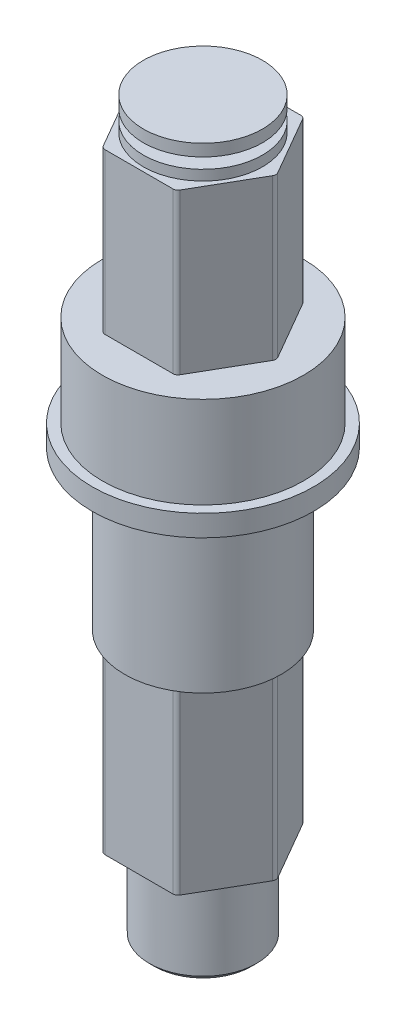
ISO-10303-21;
HEADER;
FILE_DESCRIPTION(('STEP AP214'),'2;1');
FILE_NAME('part.step','',(''),(''),'','','');
FILE_SCHEMA(('AUTOMOTIVE_DESIGN { 1 0 10303 214 1 1 1 1 }'));
ENDSEC;
DATA;
#1=APPLICATION_CONTEXT('core data for automotive mechanical design processes');
#2=APPLICATION_PROTOCOL_DEFINITION('international standard','automotive_design',2000,#1);
#3=PRODUCT_CONTEXT('',#1,'mechanical');
#4=PRODUCT('Part','Part','',(#3));
#5=PRODUCT_RELATED_PRODUCT_CATEGORY('part','',(#4));
#6=PRODUCT_DEFINITION_FORMATION('','',#4);
#7=PRODUCT_DEFINITION_CONTEXT('part definition',#1,'design');
#8=PRODUCT_DEFINITION('design','',#6,#7);
#9=PRODUCT_DEFINITION_SHAPE('','',#8);
#10=(LENGTH_UNIT() NAMED_UNIT(*) SI_UNIT(.MILLI.,.METRE.));
#11=(NAMED_UNIT(*) PLANE_ANGLE_UNIT() SI_UNIT($,.RADIAN.));
#12=(NAMED_UNIT(*) SI_UNIT($,.STERADIAN.) SOLID_ANGLE_UNIT());
#13=UNCERTAINTY_MEASURE_WITH_UNIT(LENGTH_MEASURE(1.E-05),#10,'distance_accuracy_value','');
#14=(GEOMETRIC_REPRESENTATION_CONTEXT(3) GLOBAL_UNCERTAINTY_ASSIGNED_CONTEXT((#13)) GLOBAL_UNIT_ASSIGNED_CONTEXT((#10,
#11,#12)) REPRESENTATION_CONTEXT('',''));
#15=CARTESIAN_POINT('',(0.,0.,0.));
#16=DIRECTION('',(0.,0.,1.));
#17=DIRECTION('',(1.,0.,0.));
#18=AXIS2_PLACEMENT_3D('',#15,#16,#17);
#19=CARTESIAN_POINT('',(0.,32.222260168,0.));
#20=DIRECTION('',(0.,1.,0.));
#21=DIRECTION('',(1.,0.,0.));
#22=AXIS2_PLACEMENT_3D('',#19,#20,#21);
#23=PLANE('',#22);
#24=CARTESIAN_POINT('',(0.,32.222260168,0.));
#25=DIRECTION('',(0.,-1.,0.));
#26=DIRECTION('',(0.,0.,1.));
#27=AXIS2_PLACEMENT_3D('',#24,#25,#26);
#28=CIRCLE('',#27,5.842);
#29=CARTESIAN_POINT('',(0.,32.222260168,5.842));
#30=VERTEX_POINT('',#29);
#31=EDGE_CURVE('E598',#30,#30,#28,.T.);
#32=ORIENTED_EDGE('',*,*,#31,.F.);
#33=EDGE_LOOP('',(#32));
#34=FACE_BOUND('',#33,.T.);
#35=CARTESIAN_POINT('',(0.,32.222260168,0.));
#36=DIRECTION('',(0.,1.,0.));
#37=DIRECTION('',(0.,0.,1.));
#38=AXIS2_PLACEMENT_3D('',#35,#36,#37);
#39=CIRCLE('',#38,8.255);
#40=CARTESIAN_POINT('',(0.,32.222260168,8.255));
#41=VERTEX_POINT('',#40);
#42=EDGE_CURVE('E417',#41,#41,#39,.T.);
#43=ORIENTED_EDGE('',*,*,#42,.F.);
#44=EDGE_LOOP('',(#43));
#45=FACE_BOUND('',#44,.T.);
#46=ADVANCED_FACE('F16',(#34,#45),#23,.F.);
#47=CARTESIAN_POINT('',(0.,20.485749986,0.));
#48=DIRECTION('',(0.,1.,0.));
#49=DIRECTION('',(1.,0.,0.));
#50=AXIS2_PLACEMENT_3D('',#47,#48,#49);
#51=PLANE('',#50);
#52=DIRECTION('',(1.,0.,0.));
#53=VECTOR('',#52,1.);
#54=CARTESIAN_POINT('',(-2.74963065701559,20.485749986,4.7625));
#55=LINE('',#54,#53);
#56=CARTESIAN_POINT('',(-2.52966020445434,20.485749986,4.7625));
#57=VERTEX_POINT('',#56);
#58=CARTESIAN_POINT('',(2.52966020445434,20.485749986,4.7625));
#59=VERTEX_POINT('',#58);
#60=EDGE_CURVE('E11',#57,#59,#55,.T.);
#61=ORIENTED_EDGE('',*,*,#60,.T.);
#62=CARTESIAN_POINT('',(2.52966020445434,20.485749986,4.3815));
#63=DIRECTION('',(0.,1.,0.));
#64=DIRECTION('',(0.,0.,1.));
#65=AXIS2_PLACEMENT_3D('',#62,#63,#64);
#66=CIRCLE('',#65,0.381);
#67=CARTESIAN_POINT('',(2.85961588329622,20.485749986,4.572));
#68=VERTEX_POINT('',#67);
#69=EDGE_CURVE('E50',#59,#68,#66,.T.);
#70=ORIENTED_EDGE('',*,*,#69,.T.);
#71=DIRECTION('',(0.5,0.,-0.866025403784439));
#72=VECTOR('',#71,1.);
#73=CARTESIAN_POINT('',(2.7496306570156,20.485749986,4.7625));
#74=LINE('',#73,#72);
#75=CARTESIAN_POINT('',(5.38927608775057,20.485749986,0.1905));
#76=VERTEX_POINT('',#75);
#77=EDGE_CURVE('E165',#68,#76,#74,.T.);
#78=ORIENTED_EDGE('',*,*,#77,.T.);
#79=CARTESIAN_POINT('',(5.05932040890869,20.485749986,0.));
#80=DIRECTION('',(0.,1.,0.));
#81=DIRECTION('',(0.,0.,1.));
#82=AXIS2_PLACEMENT_3D('',#79,#80,#81);
#83=CIRCLE('',#82,0.381);
#84=CARTESIAN_POINT('',(5.38927608775056,20.485749986,-0.1905));
#85=VERTEX_POINT('',#84);
#86=EDGE_CURVE('E154',#76,#85,#83,.T.);
#87=ORIENTED_EDGE('',*,*,#86,.T.);
#88=DIRECTION('',(-0.5,0.,-0.866025403784439));
#89=VECTOR('',#88,1.);
#90=CARTESIAN_POINT('',(5.49926131403119,20.485749986,0.));
#91=LINE('',#90,#89);
#92=CARTESIAN_POINT('',(2.85961588329622,20.485749986,-4.572));
#93=VERTEX_POINT('',#92);
#94=EDGE_CURVE('E157',#85,#93,#91,.T.);
#95=ORIENTED_EDGE('',*,*,#94,.T.);
#96=CARTESIAN_POINT('',(2.52966020445434,20.485749986,-4.3815));
#97=DIRECTION('',(0.,1.,0.));
#98=DIRECTION('',(0.,0.,1.));
#99=AXIS2_PLACEMENT_3D('',#96,#97,#98);
#100=CIRCLE('',#99,0.381);
#101=CARTESIAN_POINT('',(2.52966020445434,20.485749986,-4.7625));
#102=VERTEX_POINT('',#101);
#103=EDGE_CURVE('E187',#93,#102,#100,.T.);
#104=ORIENTED_EDGE('',*,*,#103,.T.);
#105=DIRECTION('',(-1.,0.,0.));
#106=VECTOR('',#105,1.);
#107=CARTESIAN_POINT('',(2.74963065701559,20.485749986,-4.7625));
#108=LINE('',#107,#106);
#109=CARTESIAN_POINT('',(-2.52966020445434,20.485749986,-4.7625));
#110=VERTEX_POINT('',#109);
#111=EDGE_CURVE('E257',#102,#110,#108,.T.);
#112=ORIENTED_EDGE('',*,*,#111,.T.);
#113=CARTESIAN_POINT('',(-2.52966020445434,20.485749986,-4.3815));
#114=DIRECTION('',(0.,1.,0.));
#115=DIRECTION('',(0.,0.,1.));
#116=AXIS2_PLACEMENT_3D('',#113,#114,#115);
#117=CIRCLE('',#116,0.381);
#118=CARTESIAN_POINT('',(-2.85961588329622,20.485749986,-4.572));
#119=VERTEX_POINT('',#118);
#120=EDGE_CURVE('E270',#110,#119,#117,.T.);
#121=ORIENTED_EDGE('',*,*,#120,.T.);
#122=DIRECTION('',(-0.5,0.,0.866025403784439));
#123=VECTOR('',#122,1.);
#124=CARTESIAN_POINT('',(-2.7496306570156,20.485749986,-4.7625));
#125=LINE('',#124,#123);
#126=CARTESIAN_POINT('',(-5.38927608775056,20.485749986,-0.190500000000003));
#127=VERTEX_POINT('',#126);
#128=EDGE_CURVE('E261',#119,#127,#125,.T.);
#129=ORIENTED_EDGE('',*,*,#128,.T.);
#130=CARTESIAN_POINT('',(-5.05932040890869,20.485749986,0.));
#131=DIRECTION('',(0.,1.,0.));
#132=DIRECTION('',(0.,0.,1.));
#133=AXIS2_PLACEMENT_3D('',#130,#131,#132);
#134=CIRCLE('',#133,0.381);
#135=CARTESIAN_POINT('',(-5.38927608775056,20.485749986,0.1905));
#136=VERTEX_POINT('',#135);
#137=EDGE_CURVE('E253',#127,#136,#134,.T.);
#138=ORIENTED_EDGE('',*,*,#137,.T.);
#139=DIRECTION('',(0.5,0.,0.866025403784439));
#140=VECTOR('',#139,1.);
#141=CARTESIAN_POINT('',(-5.49926131403119,20.485749986,0.));
#142=LINE('',#141,#140);
#143=CARTESIAN_POINT('',(-2.85961588329622,20.485749986,4.572));
#144=VERTEX_POINT('',#143);
#145=EDGE_CURVE('E243',#136,#144,#142,.T.);
#146=ORIENTED_EDGE('',*,*,#145,.T.);
#147=CARTESIAN_POINT('',(-2.52966020445434,20.485749986,4.3815));
#148=DIRECTION('',(0.,1.,0.));
#149=DIRECTION('',(0.,0.,1.));
#150=AXIS2_PLACEMENT_3D('',#147,#148,#149);
#151=CIRCLE('',#150,0.381);
#152=EDGE_CURVE('E240',#144,#57,#151,.T.);
#153=ORIENTED_EDGE('',*,*,#152,.T.);
#154=EDGE_LOOP('',(#61,#70,#78,#87,#95,#104,#112,#121,#129,#138,#146,#153));
#155=FACE_BOUND('',#154,.T.);
#156=CARTESIAN_POINT('',(0.,20.485749986,0.));
#157=DIRECTION('',(0.,1.,0.));
#158=DIRECTION('',(0.,0.,1.));
#159=AXIS2_PLACEMENT_3D('',#156,#157,#158);
#160=CIRCLE('',#159,5.842);
#161=CARTESIAN_POINT('',(0.,20.485749986,5.842));
#162=VERTEX_POINT('',#161);
#163=EDGE_CURVE('E605',#162,#162,#160,.T.);
#164=ORIENTED_EDGE('',*,*,#163,.F.);
#165=EDGE_LOOP('',(#164));
#166=FACE_BOUND('',#165,.T.);
#167=ADVANCED_FACE('F18',(#155,#166),#51,.F.);
#168=CARTESIAN_POINT('',(-2.74963065701559,52.705,4.7625));
#169=DIRECTION('',(0.,0.,-1.));
#170=DIRECTION('',(0.,-1.,0.));
#171=AXIS2_PLACEMENT_3D('',#168,#169,#170);
#172=PLANE('',#171);
#173=DIRECTION('',(-1.,0.,0.));
#174=VECTOR('',#173,1.);
#175=CARTESIAN_POINT('',(-2.74963065701559,7.023749986,4.7625));
#176=LINE('',#175,#174);
#177=CARTESIAN_POINT('',(2.52966020445434,7.023749986,4.7625));
#178=VERTEX_POINT('',#177);
#179=CARTESIAN_POINT('',(-2.52966020445434,7.023749986,4.7625));
#180=VERTEX_POINT('',#179);
#181=EDGE_CURVE('E209',#178,#180,#176,.T.);
#182=ORIENTED_EDGE('',*,*,#181,.F.);
#183=DIRECTION('',(0.,1.,0.));
#184=VECTOR('',#183,1.);
#185=CARTESIAN_POINT('',(2.52966020445434,52.705,4.7625));
#186=LINE('',#185,#184);
#187=EDGE_CURVE('E25',#178,#59,#186,.T.);
#188=ORIENTED_EDGE('',*,*,#187,.T.);
#189=ORIENTED_EDGE('',*,*,#60,.F.);
#190=DIRECTION('',(0.,-1.,0.));
#191=VECTOR('',#190,1.);
#192=CARTESIAN_POINT('',(-2.52966020445434,52.705,4.7625));
#193=LINE('',#192,#191);
#194=EDGE_CURVE('E241',#57,#180,#193,.T.);
#195=ORIENTED_EDGE('',*,*,#194,.T.);
#196=EDGE_LOOP('',(#182,#188,#189,#195));
#197=FACE_BOUND('',#196,.T.);
#198=ADVANCED_FACE('F307',(#197),#172,.F.);
#199=CARTESIAN_POINT('',(2.52966020445434,52.705,4.3815));
#200=DIRECTION('',(0.,-1.,0.));
#201=DIRECTION('',(0.,0.,-1.));
#202=AXIS2_PLACEMENT_3D('',#199,#200,#201);
#203=CYLINDRICAL_SURFACE('',#202,0.381);
#204=ORIENTED_EDGE('',*,*,#69,.F.);
#205=ORIENTED_EDGE('',*,*,#187,.F.);
#206=CARTESIAN_POINT('',(2.52966020445434,7.023749986,4.3815));
#207=DIRECTION('',(0.,-1.,0.));
#208=DIRECTION('',(0.,0.,-1.));
#209=AXIS2_PLACEMENT_3D('',#206,#207,#208);
#210=CIRCLE('',#209,0.381);
#211=CARTESIAN_POINT('',(2.85961588329622,7.023749986,4.572));
#212=VERTEX_POINT('',#211);
#213=EDGE_CURVE('E206',#212,#178,#210,.T.);
#214=ORIENTED_EDGE('',*,*,#213,.F.);
#215=DIRECTION('',(0.,-1.,0.));
#216=VECTOR('',#215,1.);
#217=CARTESIAN_POINT('',(2.85961588329622,52.705,4.572));
#218=LINE('',#217,#216);
#219=EDGE_CURVE('E195',#68,#212,#218,.T.);
#220=ORIENTED_EDGE('',*,*,#219,.F.);
#221=EDGE_LOOP('',(#204,#205,#214,#220));
#222=FACE_BOUND('',#221,.T.);
#223=ADVANCED_FACE('F313',(#222),#203,.T.);
#224=CARTESIAN_POINT('',(2.7496306570156,52.705,4.7625));
#225=DIRECTION('',(-0.866025403784439,0.,-0.5));
#226=DIRECTION('',(-0.5,0.,0.866025403784439));
#227=AXIS2_PLACEMENT_3D('',#224,#225,#226);
#228=PLANE('',#227);
#229=ORIENTED_EDGE('',*,*,#77,.F.);
#230=ORIENTED_EDGE('',*,*,#219,.T.);
#231=DIRECTION('',(-0.5,0.,0.866025403784439));
#232=VECTOR('',#231,1.);
#233=CARTESIAN_POINT('',(2.7496306570156,7.023749986,4.7625));
#234=LINE('',#233,#232);
#235=CARTESIAN_POINT('',(5.38927608775056,7.023749986,0.1905));
#236=VERTEX_POINT('',#235);
#237=EDGE_CURVE('E211',#236,#212,#234,.T.);
#238=ORIENTED_EDGE('',*,*,#237,.F.);
#239=DIRECTION('',(0.,1.,0.));
#240=VECTOR('',#239,1.);
#241=CARTESIAN_POINT('',(5.38927608775056,52.705,0.1905));
#242=LINE('',#241,#240);
#243=EDGE_CURVE('E167',#236,#76,#242,.T.);
#244=ORIENTED_EDGE('',*,*,#243,.T.);
#245=EDGE_LOOP('',(#229,#230,#238,#244));
#246=FACE_BOUND('',#245,.T.);
#247=ADVANCED_FACE('F311',(#246),#228,.F.);
#248=CARTESIAN_POINT('',(5.05932040890869,52.705,0.));
#249=DIRECTION('',(0.,-1.,0.));
#250=DIRECTION('',(0.,0.,-1.));
#251=AXIS2_PLACEMENT_3D('',#248,#249,#250);
#252=CYLINDRICAL_SURFACE('',#251,0.381);
#253=ORIENTED_EDGE('',*,*,#86,.F.);
#254=ORIENTED_EDGE('',*,*,#243,.F.);
#255=CARTESIAN_POINT('',(5.05932040890869,7.023749986,0.));
#256=DIRECTION('',(0.,-1.,0.));
#257=DIRECTION('',(0.,0.,-1.));
#258=AXIS2_PLACEMENT_3D('',#255,#256,#257);
#259=CIRCLE('',#258,0.381);
#260=CARTESIAN_POINT('',(5.38927608775056,7.023749986,-0.1905));
#261=VERTEX_POINT('',#260);
#262=EDGE_CURVE('E172',#261,#236,#259,.T.);
#263=ORIENTED_EDGE('',*,*,#262,.F.);
#264=DIRECTION('',(0.,-1.,0.));
#265=VECTOR('',#264,1.);
#266=CARTESIAN_POINT('',(5.38927608775056,52.705,-0.1905));
#267=LINE('',#266,#265);
#268=EDGE_CURVE('E170',#85,#261,#267,.T.);
#269=ORIENTED_EDGE('',*,*,#268,.F.);
#270=EDGE_LOOP('',(#253,#254,#263,#269));
#271=FACE_BOUND('',#270,.T.);
#272=ADVANCED_FACE('F168',(#271),#252,.T.);
#273=CARTESIAN_POINT('',(5.49926131403119,52.705,0.));
#274=DIRECTION('',(-0.866025403784439,0.,0.5));
#275=DIRECTION('',(0.,1.,0.));
#276=AXIS2_PLACEMENT_3D('',#273,#274,#275);
#277=PLANE('',#276);
#278=ORIENTED_EDGE('',*,*,#94,.F.);
#279=ORIENTED_EDGE('',*,*,#268,.T.);
#280=DIRECTION('',(0.5,0.,0.866025403784439));
#281=VECTOR('',#280,1.);
#282=CARTESIAN_POINT('',(5.49926131403119,7.023749986,0.));
#283=LINE('',#282,#281);
#284=CARTESIAN_POINT('',(2.85961588329622,7.023749986,-4.572));
#285=VERTEX_POINT('',#284);
#286=EDGE_CURVE('E233',#285,#261,#283,.T.);
#287=ORIENTED_EDGE('',*,*,#286,.F.);
#288=DIRECTION('',(0.,1.,0.));
#289=VECTOR('',#288,1.);
#290=CARTESIAN_POINT('',(2.85961588329622,52.705,-4.572));
#291=LINE('',#290,#289);
#292=EDGE_CURVE('E179',#285,#93,#291,.T.);
#293=ORIENTED_EDGE('',*,*,#292,.T.);
#294=EDGE_LOOP('',(#278,#279,#287,#293));
#295=FACE_BOUND('',#294,.T.);
#296=ADVANCED_FACE('F178',(#295),#277,.F.);
#297=CARTESIAN_POINT('',(2.52966020445434,52.705,-4.3815));
#298=DIRECTION('',(0.,-1.,0.));
#299=DIRECTION('',(0.,0.,-1.));
#300=AXIS2_PLACEMENT_3D('',#297,#298,#299);
#301=CYLINDRICAL_SURFACE('',#300,0.381);
#302=ORIENTED_EDGE('',*,*,#103,.F.);
#303=ORIENTED_EDGE('',*,*,#292,.F.);
#304=CARTESIAN_POINT('',(2.52966020445434,7.023749986,-4.3815));
#305=DIRECTION('',(0.,-1.,0.));
#306=DIRECTION('',(0.,0.,-1.));
#307=AXIS2_PLACEMENT_3D('',#304,#305,#306);
#308=CIRCLE('',#307,0.381);
#309=CARTESIAN_POINT('',(2.52966020445434,7.023749986,-4.7625));
#310=VERTEX_POINT('',#309);
#311=EDGE_CURVE('E228',#310,#285,#308,.T.);
#312=ORIENTED_EDGE('',*,*,#311,.F.);
#313=DIRECTION('',(0.,-1.,0.));
#314=VECTOR('',#313,1.);
#315=CARTESIAN_POINT('',(2.52966020445434,52.705,-4.7625));
#316=LINE('',#315,#314);
#317=EDGE_CURVE('E260',#102,#310,#316,.T.);
#318=ORIENTED_EDGE('',*,*,#317,.F.);
#319=EDGE_LOOP('',(#302,#303,#312,#318));
#320=FACE_BOUND('',#319,.T.);
#321=ADVANCED_FACE('F351',(#320),#301,.T.);
#322=CARTESIAN_POINT('',(2.74963065701559,52.705,-4.7625));
#323=DIRECTION('',(0.,0.,1.));
#324=DIRECTION('',(1.,0.,0.));
#325=AXIS2_PLACEMENT_3D('',#322,#323,#324);
#326=PLANE('',#325);
#327=ORIENTED_EDGE('',*,*,#111,.F.);
#328=ORIENTED_EDGE('',*,*,#317,.T.);
#329=DIRECTION('',(1.,0.,0.));
#330=VECTOR('',#329,1.);
#331=CARTESIAN_POINT('',(2.74963065701559,7.023749986,-4.7625));
#332=LINE('',#331,#330);
#333=CARTESIAN_POINT('',(-2.52966020445434,7.023749986,-4.7625));
#334=VERTEX_POINT('',#333);
#335=EDGE_CURVE('E223',#334,#310,#332,.T.);
#336=ORIENTED_EDGE('',*,*,#335,.F.);
#337=DIRECTION('',(0.,1.,0.));
#338=VECTOR('',#337,1.);
#339=CARTESIAN_POINT('',(-2.52966020445434,52.705,-4.7625));
#340=LINE('',#339,#338);
#341=EDGE_CURVE('E268',#334,#110,#340,.T.);
#342=ORIENTED_EDGE('',*,*,#341,.T.);
#343=EDGE_LOOP('',(#327,#328,#336,#342));
#344=FACE_BOUND('',#343,.T.);
#345=ADVANCED_FACE('F281',(#344),#326,.F.);
#346=CARTESIAN_POINT('',(-2.52966020445434,52.705,-4.3815));
#347=DIRECTION('',(0.,-1.,0.));
#348=DIRECTION('',(0.,0.,-1.));
#349=AXIS2_PLACEMENT_3D('',#346,#347,#348);
#350=CYLINDRICAL_SURFACE('',#349,0.381);
#351=ORIENTED_EDGE('',*,*,#120,.F.);
#352=ORIENTED_EDGE('',*,*,#341,.F.);
#353=CARTESIAN_POINT('',(-2.52966020445434,7.023749986,-4.3815));
#354=DIRECTION('',(0.,-1.,0.));
#355=DIRECTION('',(0.,0.,-1.));
#356=AXIS2_PLACEMENT_3D('',#353,#354,#355);
#357=CIRCLE('',#356,0.381);
#358=CARTESIAN_POINT('',(-2.85961588329622,7.023749986,-4.572));
#359=VERTEX_POINT('',#358);
#360=EDGE_CURVE('E219',#359,#334,#357,.T.);
#361=ORIENTED_EDGE('',*,*,#360,.F.);
#362=DIRECTION('',(0.,-1.,0.));
#363=VECTOR('',#362,1.);
#364=CARTESIAN_POINT('',(-2.85961588329622,52.705,-4.572));
#365=LINE('',#364,#363);
#366=EDGE_CURVE('E262',#119,#359,#365,.T.);
#367=ORIENTED_EDGE('',*,*,#366,.F.);
#368=EDGE_LOOP('',(#351,#352,#361,#367));
#369=FACE_BOUND('',#368,.T.);
#370=ADVANCED_FACE('F283',(#369),#350,.T.);
#371=CARTESIAN_POINT('',(-2.74963065701559,52.705,-4.7625));
#372=DIRECTION('',(0.866025403784439,0.,0.5));
#373=DIRECTION('',(0.,-1.,0.));
#374=AXIS2_PLACEMENT_3D('',#371,#372,#373);
#375=PLANE('',#374);
#376=DIRECTION('',(0.5,0.,-0.866025403784439));
#377=VECTOR('',#376,1.);
#378=CARTESIAN_POINT('',(-2.74963065701559,7.023749986,-4.7625));
#379=LINE('',#378,#377);
#380=CARTESIAN_POINT('',(-5.38927608775056,7.023749986,-0.1905));
#381=VERTEX_POINT('',#380);
#382=EDGE_CURVE('E216',#381,#359,#379,.T.);
#383=ORIENTED_EDGE('',*,*,#382,.F.);
#384=DIRECTION('',(0.,1.,0.));
#385=VECTOR('',#384,1.);
#386=CARTESIAN_POINT('',(-5.38927608775056,52.705,-0.1905));
#387=LINE('',#386,#385);
#388=EDGE_CURVE('E255',#381,#127,#387,.T.);
#389=ORIENTED_EDGE('',*,*,#388,.T.);
#390=ORIENTED_EDGE('',*,*,#128,.F.);
#391=ORIENTED_EDGE('',*,*,#366,.T.);
#392=EDGE_LOOP('',(#383,#389,#390,#391));
#393=FACE_BOUND('',#392,.T.);
#394=ADVANCED_FACE('F343',(#393),#375,.F.);
#395=CARTESIAN_POINT('',(-5.05932040890869,52.705,0.));
#396=DIRECTION('',(0.,-1.,0.));
#397=DIRECTION('',(0.,0.,-1.));
#398=AXIS2_PLACEMENT_3D('',#395,#396,#397);
#399=CYLINDRICAL_SURFACE('',#398,0.381);
#400=ORIENTED_EDGE('',*,*,#137,.F.);
#401=ORIENTED_EDGE('',*,*,#388,.F.);
#402=CARTESIAN_POINT('',(-5.05932040890869,7.023749986,0.));
#403=DIRECTION('',(0.,-1.,0.));
#404=DIRECTION('',(0.,0.,-1.));
#405=AXIS2_PLACEMENT_3D('',#402,#403,#404);
#406=CIRCLE('',#405,0.381);
#407=CARTESIAN_POINT('',(-5.38927608775056,7.023749986,0.1905));
#408=VERTEX_POINT('',#407);
#409=EDGE_CURVE('E222',#408,#381,#406,.T.);
#410=ORIENTED_EDGE('',*,*,#409,.F.);
#411=DIRECTION('',(0.,-1.,0.));
#412=VECTOR('',#411,1.);
#413=CARTESIAN_POINT('',(-5.38927608775056,52.705,0.1905));
#414=LINE('',#413,#412);
#415=EDGE_CURVE('E248',#136,#408,#414,.T.);
#416=ORIENTED_EDGE('',*,*,#415,.F.);
#417=EDGE_LOOP('',(#400,#401,#410,#416));
#418=FACE_BOUND('',#417,.T.);
#419=ADVANCED_FACE('F338',(#418),#399,.T.);
#420=CARTESIAN_POINT('',(-5.49926131403119,52.705,0.));
#421=DIRECTION('',(0.866025403784439,0.,-0.5));
#422=DIRECTION('',(0.,-1.,0.));
#423=AXIS2_PLACEMENT_3D('',#420,#421,#422);
#424=PLANE('',#423);
#425=DIRECTION('',(-0.5,0.,-0.866025403784439));
#426=VECTOR('',#425,1.);
#427=CARTESIAN_POINT('',(-5.49926131403119,7.023749986,0.));
#428=LINE('',#427,#426);
#429=CARTESIAN_POINT('',(-2.85961588329622,7.023749986,4.572));
#430=VERTEX_POINT('',#429);
#431=EDGE_CURVE('E451',#430,#408,#428,.T.);
#432=ORIENTED_EDGE('',*,*,#431,.F.);
#433=DIRECTION('',(0.,1.,0.));
#434=VECTOR('',#433,1.);
#435=CARTESIAN_POINT('',(-2.85961588329622,52.705,4.572));
#436=LINE('',#435,#434);
#437=EDGE_CURVE('E236',#430,#144,#436,.T.);
#438=ORIENTED_EDGE('',*,*,#437,.T.);
#439=ORIENTED_EDGE('',*,*,#145,.F.);
#440=ORIENTED_EDGE('',*,*,#415,.T.);
#441=EDGE_LOOP('',(#432,#438,#439,#440));
#442=FACE_BOUND('',#441,.T.);
#443=ADVANCED_FACE('F333',(#442),#424,.F.);
#444=CARTESIAN_POINT('',(-2.52966020445434,52.705,4.3815));
#445=DIRECTION('',(0.,-1.,0.));
#446=DIRECTION('',(0.,0.,-1.));
#447=AXIS2_PLACEMENT_3D('',#444,#445,#446);
#448=CYLINDRICAL_SURFACE('',#447,0.381);
#449=ORIENTED_EDGE('',*,*,#152,.F.);
#450=ORIENTED_EDGE('',*,*,#437,.F.);
#451=CARTESIAN_POINT('',(-2.52966020445434,7.023749986,4.3815));
#452=DIRECTION('',(0.,-1.,0.));
#453=DIRECTION('',(0.,0.,-1.));
#454=AXIS2_PLACEMENT_3D('',#451,#452,#453);
#455=CIRCLE('',#454,0.381);
#456=EDGE_CURVE('E214',#180,#430,#455,.T.);
#457=ORIENTED_EDGE('',*,*,#456,.F.);
#458=ORIENTED_EDGE('',*,*,#194,.F.);
#459=EDGE_LOOP('',(#449,#450,#457,#458));
#460=FACE_BOUND('',#459,.T.);
#461=ADVANCED_FACE('F339',(#460),#448,.T.);
#462=CARTESIAN_POINT('',(0.,7.023749986,0.));
#463=DIRECTION('',(0.,-1.,0.));
#464=DIRECTION('',(0.,0.,-1.));
#465=AXIS2_PLACEMENT_3D('',#462,#463,#464);
#466=PLANE('',#465);
#467=CARTESIAN_POINT('',(0.,7.023749986,0.));
#468=DIRECTION('',(0.,-1.,0.));
#469=DIRECTION('',(0.,0.,-1.));
#470=AXIS2_PLACEMENT_3D('',#467,#468,#469);
#471=CIRCLE('',#470,4.);
#472=CARTESIAN_POINT('',(0.,7.023749986,-4.));
#473=VERTEX_POINT('',#472);
#474=EDGE_CURVE('E592',#473,#473,#471,.T.);
#475=ORIENTED_EDGE('',*,*,#474,.F.);
#476=EDGE_LOOP('',(#475));
#477=FACE_BOUND('',#476,.T.);
#478=ORIENTED_EDGE('',*,*,#237,.T.);
#479=ORIENTED_EDGE('',*,*,#213,.T.);
#480=ORIENTED_EDGE('',*,*,#181,.T.);
#481=ORIENTED_EDGE('',*,*,#456,.T.);
#482=ORIENTED_EDGE('',*,*,#431,.T.);
#483=ORIENTED_EDGE('',*,*,#409,.T.);
#484=ORIENTED_EDGE('',*,*,#382,.T.);
#485=ORIENTED_EDGE('',*,*,#360,.T.);
#486=ORIENTED_EDGE('',*,*,#335,.T.);
#487=ORIENTED_EDGE('',*,*,#311,.T.);
#488=ORIENTED_EDGE('',*,*,#286,.T.);
#489=ORIENTED_EDGE('',*,*,#262,.T.);
#490=EDGE_LOOP('',(#478,#479,#480,#481,#482,#483,#484,#485,#486,#487,#488,#489));
#491=FACE_BOUND('',#490,.T.);
#492=ADVANCED_FACE('F334',(#477,#491),#466,.T.);
#493=CARTESIAN_POINT('',(0.,0.508,0.));
#494=DIRECTION('',(0.,1.,0.));
#495=DIRECTION('',(1.,0.,0.));
#496=AXIS2_PLACEMENT_3D('',#493,#494,#495);
#497=PLANE('',#496);
#498=CARTESIAN_POINT('',(0.,0.508,0.));
#499=DIRECTION('',(0.,-1.,0.));
#500=DIRECTION('',(0.,0.,1.));
#501=AXIS2_PLACEMENT_3D('',#498,#499,#500);
#502=CIRCLE('',#501,3.619);
#503=CARTESIAN_POINT('',(0.,0.508,3.619));
#504=VERTEX_POINT('',#503);
#505=EDGE_CURVE('E416',#504,#504,#502,.T.);
#506=ORIENTED_EDGE('',*,*,#505,.T.);
#507=EDGE_LOOP('',(#506));
#508=FACE_BOUND('',#507,.T.);
#509=ADVANCED_FACE('F405',(#508),#497,.F.);
#510=CARTESIAN_POINT('',(0.,33.809760168,0.));
#511=DIRECTION('',(0.,1.,0.));
#512=DIRECTION('',(1.,0.,0.));
#513=AXIS2_PLACEMENT_3D('',#510,#511,#512);
#514=PLANE('',#513);
#515=CARTESIAN_POINT('',(0.,33.809760168,0.));
#516=DIRECTION('',(0.,1.,0.));
#517=DIRECTION('',(0.,0.,1.));
#518=AXIS2_PLACEMENT_3D('',#515,#516,#517);
#519=CIRCLE('',#518,7.499999986);
#520=CARTESIAN_POINT('',(0.,33.809760168,7.499999986));
#521=VERTEX_POINT('',#520);
#522=EDGE_CURVE('E411',#521,#521,#519,.T.);
#523=ORIENTED_EDGE('',*,*,#522,.F.);
#524=EDGE_LOOP('',(#523));
#525=FACE_BOUND('',#524,.T.);
#526=CARTESIAN_POINT('',(0.,33.809760168,0.));
#527=DIRECTION('',(0.,1.,0.));
#528=DIRECTION('',(0.,0.,1.));
#529=AXIS2_PLACEMENT_3D('',#526,#527,#528);
#530=CIRCLE('',#529,8.255);
#531=CARTESIAN_POINT('',(0.,33.809760168,8.255));
#532=VERTEX_POINT('',#531);
#533=EDGE_CURVE('E412',#532,#532,#530,.T.);
#534=ORIENTED_EDGE('',*,*,#533,.T.);
#535=EDGE_LOOP('',(#534));
#536=FACE_BOUND('',#535,.T.);
#537=ADVANCED_FACE('F398',(#525,#536),#514,.T.);
#538=CARTESIAN_POINT('',(-2.52966020445434,52.705,4.3815));
#539=DIRECTION('',(0.,1.,0.));
#540=DIRECTION('',(0.,0.,1.));
#541=AXIS2_PLACEMENT_3D('',#538,#539,#540);
#542=CYLINDRICAL_SURFACE('',#541,0.381);
#543=CARTESIAN_POINT('',(-2.52966020445434,40.64,4.3815));
#544=DIRECTION('',(0.,-1.,0.));
#545=DIRECTION('',(0.,0.,1.));
#546=AXIS2_PLACEMENT_3D('',#543,#544,#545);
#547=CIRCLE('',#546,0.381);
#548=CARTESIAN_POINT('',(-2.52966020445434,40.64,4.7625));
#549=VERTEX_POINT('',#548);
#550=CARTESIAN_POINT('',(-2.85961588329622,40.64,4.572));
#551=VERTEX_POINT('',#550);
#552=EDGE_CURVE('E554',#549,#551,#547,.T.);
#553=ORIENTED_EDGE('',*,*,#552,.F.);
#554=DIRECTION('',(0.,-1.,0.));
#555=VECTOR('',#554,1.);
#556=CARTESIAN_POINT('',(-2.52966020445434,52.705,4.7625));
#557=LINE('',#556,#555);
#558=CARTESIAN_POINT('',(-2.52966020445434,52.578,4.7625));
#559=VERTEX_POINT('',#558);
#560=EDGE_CURVE('E503',#559,#549,#557,.T.);
#561=ORIENTED_EDGE('',*,*,#560,.F.);
#562=CARTESIAN_POINT('',(-2.52966020445434,52.578,4.3815));
#563=DIRECTION('',(0.,1.,0.));
#564=DIRECTION('',(0.,0.,1.));
#565=AXIS2_PLACEMENT_3D('',#562,#563,#564);
#566=CIRCLE('',#565,0.381);
#567=CARTESIAN_POINT('',(-2.85961588329622,52.578,4.572));
#568=VERTEX_POINT('',#567);
#569=EDGE_CURVE('E489',#568,#559,#566,.T.);
#570=ORIENTED_EDGE('',*,*,#569,.F.);
#571=DIRECTION('',(0.,1.,0.));
#572=VECTOR('',#571,1.);
#573=CARTESIAN_POINT('',(-2.85961588329622,52.705,4.572));
#574=LINE('',#573,#572);
#575=EDGE_CURVE('E524',#551,#568,#574,.T.);
#576=ORIENTED_EDGE('',*,*,#575,.F.);
#577=EDGE_LOOP('',(#553,#561,#570,#576));
#578=FACE_BOUND('',#577,.T.);
#579=ADVANCED_FACE('F395',(#578),#542,.T.);
#580=CARTESIAN_POINT('',(2.52966020445434,52.705,4.3815));
#581=DIRECTION('',(0.,1.,0.));
#582=DIRECTION('',(0.,0.,1.));
#583=AXIS2_PLACEMENT_3D('',#580,#581,#582);
#584=CYLINDRICAL_SURFACE('',#583,0.381);
#585=CARTESIAN_POINT('',(2.52966020445434,40.64,4.3815));
#586=DIRECTION('',(0.,-1.,0.));
#587=DIRECTION('',(0.,0.,1.));
#588=AXIS2_PLACEMENT_3D('',#585,#586,#587);
#589=CIRCLE('',#588,0.381);
#590=CARTESIAN_POINT('',(2.85961588329622,40.64,4.572));
#591=VERTEX_POINT('',#590);
#592=CARTESIAN_POINT('',(2.52966020445434,40.64,4.7625));
#593=VERTEX_POINT('',#592);
#594=EDGE_CURVE('E557',#591,#593,#589,.T.);
#595=ORIENTED_EDGE('',*,*,#594,.F.);
#596=DIRECTION('',(0.,-1.,0.));
#597=VECTOR('',#596,1.);
#598=CARTESIAN_POINT('',(2.85961588329622,52.705,4.572));
#599=LINE('',#598,#597);
#600=CARTESIAN_POINT('',(2.85961588329622,52.578,4.572));
#601=VERTEX_POINT('',#600);
#602=EDGE_CURVE('E500',#601,#591,#599,.T.);
#603=ORIENTED_EDGE('',*,*,#602,.F.);
#604=CARTESIAN_POINT('',(2.52966020445434,52.578,4.3815));
#605=DIRECTION('',(0.,1.,0.));
#606=DIRECTION('',(0.,0.,1.));
#607=AXIS2_PLACEMENT_3D('',#604,#605,#606);
#608=CIRCLE('',#607,0.381);
#609=CARTESIAN_POINT('',(2.52966020445434,52.578,4.7625));
#610=VERTEX_POINT('',#609);
#611=EDGE_CURVE('E484',#610,#601,#608,.T.);
#612=ORIENTED_EDGE('',*,*,#611,.F.);
#613=DIRECTION('',(0.,1.,0.));
#614=VECTOR('',#613,1.);
#615=CARTESIAN_POINT('',(2.52966020445434,52.705,4.7625));
#616=LINE('',#615,#614);
#617=EDGE_CURVE('E467',#593,#610,#616,.T.);
#618=ORIENTED_EDGE('',*,*,#617,.F.);
#619=EDGE_LOOP('',(#595,#603,#612,#618));
#620=FACE_BOUND('',#619,.T.);
#621=ADVANCED_FACE('F392',(#620),#584,.T.);
#622=CARTESIAN_POINT('',(5.05932040890869,52.705,0.));
#623=DIRECTION('',(0.,1.,0.));
#624=DIRECTION('',(0.,0.,1.));
#625=AXIS2_PLACEMENT_3D('',#622,#623,#624);
#626=CYLINDRICAL_SURFACE('',#625,0.381);
#627=CARTESIAN_POINT('',(5.05932040890869,40.64,0.));
#628=DIRECTION('',(0.,-1.,0.));
#629=DIRECTION('',(0.,0.,1.));
#630=AXIS2_PLACEMENT_3D('',#627,#628,#629);
#631=CIRCLE('',#630,0.381);
#632=CARTESIAN_POINT('',(5.38927608775056,40.64,-0.1905));
#633=VERTEX_POINT('',#632);
#634=CARTESIAN_POINT('',(5.38927608775056,40.64,0.1905));
#635=VERTEX_POINT('',#634);
#636=EDGE_CURVE('E545',#633,#635,#631,.T.);
#637=ORIENTED_EDGE('',*,*,#636,.F.);
#638=DIRECTION('',(0.,-1.,0.));
#639=VECTOR('',#638,1.);
#640=CARTESIAN_POINT('',(5.38927608775056,52.705,-0.1905));
#641=LINE('',#640,#639);
#642=CARTESIAN_POINT('',(5.38927608775056,52.578,-0.1905));
#643=VERTEX_POINT('',#642);
#644=EDGE_CURVE('E566',#643,#633,#641,.T.);
#645=ORIENTED_EDGE('',*,*,#644,.F.);
#646=CARTESIAN_POINT('',(5.05932040890869,52.578,0.));
#647=DIRECTION('',(0.,1.,0.));
#648=DIRECTION('',(0.,0.,1.));
#649=AXIS2_PLACEMENT_3D('',#646,#647,#648);
#650=CIRCLE('',#649,0.381);
#651=CARTESIAN_POINT('',(5.38927608775056,52.578,0.1905));
#652=VERTEX_POINT('',#651);
#653=EDGE_CURVE('E487',#652,#643,#650,.T.);
#654=ORIENTED_EDGE('',*,*,#653,.F.);
#655=DIRECTION('',(0.,1.,0.));
#656=VECTOR('',#655,1.);
#657=CARTESIAN_POINT('',(5.38927608775056,52.705,0.1905));
#658=LINE('',#657,#656);
#659=EDGE_CURVE('E476',#635,#652,#658,.T.);
#660=ORIENTED_EDGE('',*,*,#659,.F.);
#661=EDGE_LOOP('',(#637,#645,#654,#660));
#662=FACE_BOUND('',#661,.T.);
#663=ADVANCED_FACE('F388',(#662),#626,.T.);
#664=CARTESIAN_POINT('',(-5.05932040890869,52.705,0.));
#665=DIRECTION('',(0.,1.,0.));
#666=DIRECTION('',(0.,0.,1.));
#667=AXIS2_PLACEMENT_3D('',#664,#665,#666);
#668=CYLINDRICAL_SURFACE('',#667,0.381);
#669=CARTESIAN_POINT('',(-5.05932040890869,40.64,0.));
#670=DIRECTION('',(0.,-1.,0.));
#671=DIRECTION('',(0.,0.,1.));
#672=AXIS2_PLACEMENT_3D('',#669,#670,#671);
#673=CIRCLE('',#672,0.381);
#674=CARTESIAN_POINT('',(-5.38927608775056,40.64,0.1905));
#675=VERTEX_POINT('',#674);
#676=CARTESIAN_POINT('',(-5.38927608775056,40.64,-0.1905));
#677=VERTEX_POINT('',#676);
#678=EDGE_CURVE('E297',#675,#677,#673,.T.);
#679=ORIENTED_EDGE('',*,*,#678,.F.);
#680=DIRECTION('',(0.,-1.,0.));
#681=VECTOR('',#680,1.);
#682=CARTESIAN_POINT('',(-5.38927608775056,52.705,0.1905));
#683=LINE('',#682,#681);
#684=CARTESIAN_POINT('',(-5.38927608775056,52.578,0.1905));
#685=VERTEX_POINT('',#684);
#686=EDGE_CURVE('E520',#685,#675,#683,.T.);
#687=ORIENTED_EDGE('',*,*,#686,.F.);
#688=CARTESIAN_POINT('',(-5.05932040890869,52.578,0.));
#689=DIRECTION('',(0.,1.,0.));
#690=DIRECTION('',(0.,0.,1.));
#691=AXIS2_PLACEMENT_3D('',#688,#689,#690);
#692=CIRCLE('',#691,0.381);
#693=CARTESIAN_POINT('',(-5.38927608775056,52.578,-0.1905));
#694=VERTEX_POINT('',#693);
#695=EDGE_CURVE('E202',#694,#685,#692,.T.);
#696=ORIENTED_EDGE('',*,*,#695,.F.);
#697=DIRECTION('',(0.,1.,0.));
#698=VECTOR('',#697,1.);
#699=CARTESIAN_POINT('',(-5.38927608775056,52.705,-0.1905));
#700=LINE('',#699,#698);
#701=EDGE_CURVE('E542',#677,#694,#700,.T.);
#702=ORIENTED_EDGE('',*,*,#701,.F.);
#703=EDGE_LOOP('',(#679,#687,#696,#702));
#704=FACE_BOUND('',#703,.T.);
#705=ADVANCED_FACE('F387',(#704),#668,.T.);
#706=CARTESIAN_POINT('',(-2.52966020445434,52.705,-4.3815));
#707=DIRECTION('',(0.,1.,0.));
#708=DIRECTION('',(0.,0.,1.));
#709=AXIS2_PLACEMENT_3D('',#706,#707,#708);
#710=CYLINDRICAL_SURFACE('',#709,0.381);
#711=CARTESIAN_POINT('',(-2.52966020445434,40.64,-4.3815));
#712=DIRECTION('',(0.,-1.,0.));
#713=DIRECTION('',(0.,0.,1.));
#714=AXIS2_PLACEMENT_3D('',#711,#712,#713);
#715=CIRCLE('',#714,0.381);
#716=CARTESIAN_POINT('',(-2.85961588329622,40.64,-4.572));
#717=VERTEX_POINT('',#716);
#718=CARTESIAN_POINT('',(-2.52966020445434,40.64,-4.7625));
#719=VERTEX_POINT('',#718);
#720=EDGE_CURVE('E543',#717,#719,#715,.T.);
#721=ORIENTED_EDGE('',*,*,#720,.F.);
#722=DIRECTION('',(0.,-1.,0.));
#723=VECTOR('',#722,1.);
#724=CARTESIAN_POINT('',(-2.85961588329622,52.705,-4.572));
#725=LINE('',#724,#723);
#726=CARTESIAN_POINT('',(-2.85961588329622,52.578,-4.572));
#727=VERTEX_POINT('',#726);
#728=EDGE_CURVE('E531',#727,#717,#725,.T.);
#729=ORIENTED_EDGE('',*,*,#728,.F.);
#730=CARTESIAN_POINT('',(-2.52966020445434,52.578,-4.3815));
#731=DIRECTION('',(0.,1.,0.));
#732=DIRECTION('',(0.,0.,1.));
#733=AXIS2_PLACEMENT_3D('',#730,#731,#732);
#734=CIRCLE('',#733,0.381);
#735=CARTESIAN_POINT('',(-2.52966020445434,52.578,-4.7625));
#736=VERTEX_POINT('',#735);
#737=EDGE_CURVE('E300',#736,#727,#734,.T.);
#738=ORIENTED_EDGE('',*,*,#737,.F.);
#739=DIRECTION('',(0.,1.,0.));
#740=VECTOR('',#739,1.);
#741=CARTESIAN_POINT('',(-2.52966020445434,52.705,-4.7625));
#742=LINE('',#741,#740);
#743=EDGE_CURVE('E435',#719,#736,#742,.T.);
#744=ORIENTED_EDGE('',*,*,#743,.F.);
#745=EDGE_LOOP('',(#721,#729,#738,#744));
#746=FACE_BOUND('',#745,.T.);
#747=ADVANCED_FACE('F386',(#746),#710,.T.);
#748=CARTESIAN_POINT('',(2.52966020445434,52.705,-4.3815));
#749=DIRECTION('',(0.,1.,0.));
#750=DIRECTION('',(0.,0.,1.));
#751=AXIS2_PLACEMENT_3D('',#748,#749,#750);
#752=CYLINDRICAL_SURFACE('',#751,0.381);
#753=CARTESIAN_POINT('',(2.52966020445434,40.64,-4.3815));
#754=DIRECTION('',(0.,-1.,0.));
#755=DIRECTION('',(0.,0.,1.));
#756=AXIS2_PLACEMENT_3D('',#753,#754,#755);
#757=CIRCLE('',#756,0.381);
#758=CARTESIAN_POINT('',(2.52966020445434,40.64,-4.7625));
#759=VERTEX_POINT('',#758);
#760=CARTESIAN_POINT('',(2.85961588329622,40.64,-4.572));
#761=VERTEX_POINT('',#760);
#762=EDGE_CURVE('E538',#759,#761,#757,.T.);
#763=ORIENTED_EDGE('',*,*,#762,.F.);
#764=DIRECTION('',(0.,-1.,0.));
#765=VECTOR('',#764,1.);
#766=CARTESIAN_POINT('',(2.52966020445434,52.705,-4.7625));
#767=LINE('',#766,#765);
#768=CARTESIAN_POINT('',(2.52966020445434,52.578,-4.7625));
#769=VERTEX_POINT('',#768);
#770=EDGE_CURVE('E555',#769,#759,#767,.T.);
#771=ORIENTED_EDGE('',*,*,#770,.F.);
#772=CARTESIAN_POINT('',(2.52966020445434,52.578,-4.3815));
#773=DIRECTION('',(0.,1.,0.));
#774=DIRECTION('',(0.,0.,1.));
#775=AXIS2_PLACEMENT_3D('',#772,#773,#774);
#776=CIRCLE('',#775,0.381);
#777=CARTESIAN_POINT('',(2.85961588329622,52.578,-4.572));
#778=VERTEX_POINT('',#777);
#779=EDGE_CURVE('E293',#778,#769,#776,.T.);
#780=ORIENTED_EDGE('',*,*,#779,.F.);
#781=DIRECTION('',(0.,1.,0.));
#782=VECTOR('',#781,1.);
#783=CARTESIAN_POINT('',(2.85961588329622,52.705,-4.572));
#784=LINE('',#783,#782);
#785=EDGE_CURVE('E507',#761,#778,#784,.T.);
#786=ORIENTED_EDGE('',*,*,#785,.F.);
#787=EDGE_LOOP('',(#763,#771,#780,#786));
#788=FACE_BOUND('',#787,.T.);
#789=ADVANCED_FACE('F383',(#788),#752,.T.);
#790=CARTESIAN_POINT('',(0.,53.34,0.));
#791=DIRECTION('',(0.,1.,0.));
#792=DIRECTION('',(1.,0.,0.));
#793=AXIS2_PLACEMENT_3D('',#790,#791,#792);
#794=PLANE('',#793);
#795=CARTESIAN_POINT('',(0.,53.34,0.));
#796=DIRECTION('',(0.,1.,0.));
#797=DIRECTION('',(0.,0.,1.));
#798=AXIS2_PLACEMENT_3D('',#795,#796,#797);
#799=CIRCLE('',#798,3.175);
#800=CARTESIAN_POINT('',(0.,53.34,3.175));
#801=VERTEX_POINT('',#800);
#802=EDGE_CURVE('E450',#801,#801,#799,.T.);
#803=ORIENTED_EDGE('',*,*,#802,.F.);
#804=EDGE_LOOP('',(#803));
#805=FACE_BOUND('',#804,.T.);
#806=CARTESIAN_POINT('',(0.,53.34,0.));
#807=DIRECTION('',(0.,1.,0.));
#808=DIRECTION('',(0.,0.,1.));
#809=AXIS2_PLACEMENT_3D('',#806,#807,#808);
#810=CIRCLE('',#809,4.445);
#811=CARTESIAN_POINT('',(0.,53.34,4.445));
#812=VERTEX_POINT('',#811);
#813=EDGE_CURVE('E437',#812,#812,#810,.T.);
#814=ORIENTED_EDGE('',*,*,#813,.T.);
#815=EDGE_LOOP('',(#814));
#816=FACE_BOUND('',#815,.T.);
#817=ADVANCED_FACE('F372',(#805,#816),#794,.T.);
#818=CARTESIAN_POINT('',(0.,54.13375,0.));
#819=DIRECTION('',(0.,1.,0.));
#820=DIRECTION('',(1.,0.,0.));
#821=AXIS2_PLACEMENT_3D('',#818,#819,#820);
#822=PLANE('',#821);
#823=CARTESIAN_POINT('',(0.,54.13375,0.));
#824=DIRECTION('',(0.,1.,0.));
#825=DIRECTION('',(0.,0.,1.));
#826=AXIS2_PLACEMENT_3D('',#823,#824,#825);
#827=CIRCLE('',#826,3.175);
#828=CARTESIAN_POINT('',(0.,54.13375,3.175));
#829=VERTEX_POINT('',#828);
#830=EDGE_CURVE('E446',#829,#829,#827,.T.);
#831=ORIENTED_EDGE('',*,*,#830,.T.);
#832=EDGE_LOOP('',(#831));
#833=FACE_BOUND('',#832,.T.);
#834=CARTESIAN_POINT('',(0.,54.13375,0.));
#835=DIRECTION('',(0.,1.,0.));
#836=DIRECTION('',(0.,0.,1.));
#837=AXIS2_PLACEMENT_3D('',#834,#835,#836);
#838=CIRCLE('',#837,4.445);
#839=CARTESIAN_POINT('',(0.,54.13375,4.445));
#840=VERTEX_POINT('',#839);
#841=EDGE_CURVE('E465',#840,#840,#838,.T.);
#842=ORIENTED_EDGE('',*,*,#841,.F.);
#843=EDGE_LOOP('',(#842));
#844=FACE_BOUND('',#843,.T.);
#845=ADVANCED_FACE('F371',(#833,#844),#822,.F.);
#846=CARTESIAN_POINT('',(0.,55.02275,0.));
#847=DIRECTION('',(0.,1.,0.));
#848=DIRECTION('',(1.,0.,0.));
#849=AXIS2_PLACEMENT_3D('',#846,#847,#848);
#850=PLANE('',#849);
#851=CARTESIAN_POINT('',(0.,55.02275,0.));
#852=DIRECTION('',(0.,1.,0.));
#853=DIRECTION('',(0.,0.,1.));
#854=AXIS2_PLACEMENT_3D('',#851,#852,#853);
#855=CIRCLE('',#854,4.445);
#856=CARTESIAN_POINT('',(0.,55.02275,4.445));
#857=VERTEX_POINT('',#856);
#858=EDGE_CURVE('E458',#857,#857,#855,.T.);
#859=ORIENTED_EDGE('',*,*,#858,.T.);
#860=EDGE_LOOP('',(#859));
#861=FACE_BOUND('',#860,.T.);
#862=ADVANCED_FACE('F369',(#861),#850,.T.);
#863=CARTESIAN_POINT('',(0.,52.578,0.));
#864=DIRECTION('',(0.,1.,0.));
#865=DIRECTION('',(1.,0.,0.));
#866=AXIS2_PLACEMENT_3D('',#863,#864,#865);
#867=PLANE('',#866);
#868=CARTESIAN_POINT('',(0.,52.578,0.));
#869=DIRECTION('',(0.,-1.,0.));
#870=DIRECTION('',(0.,0.,1.));
#871=AXIS2_PLACEMENT_3D('',#868,#869,#870);
#872=CIRCLE('',#871,4.445);
#873=CARTESIAN_POINT('',(0.,52.578,4.445));
#874=VERTEX_POINT('',#873);
#875=EDGE_CURVE('E444',#874,#874,#872,.T.);
#876=ORIENTED_EDGE('',*,*,#875,.T.);
#877=EDGE_LOOP('',(#876));
#878=FACE_BOUND('',#877,.T.);
#879=DIRECTION('',(-0.5,0.,-0.866025403784439));
#880=VECTOR('',#879,1.);
#881=CARTESIAN_POINT('',(5.49926131403119,52.578,0.));
#882=LINE('',#881,#880);
#883=EDGE_CURVE('E513',#643,#778,#882,.T.);
#884=ORIENTED_EDGE('',*,*,#883,.T.);
#885=ORIENTED_EDGE('',*,*,#779,.T.);
#886=DIRECTION('',(-1.,0.,0.));
#887=VECTOR('',#886,1.);
#888=CARTESIAN_POINT('',(2.74963065701559,52.578,-4.7625));
#889=LINE('',#888,#887);
#890=EDGE_CURVE('E547',#769,#736,#889,.T.);
#891=ORIENTED_EDGE('',*,*,#890,.T.);
#892=ORIENTED_EDGE('',*,*,#737,.T.);
#893=DIRECTION('',(-0.5,0.,0.866025403784439));
#894=VECTOR('',#893,1.);
#895=CARTESIAN_POINT('',(-2.74963065701559,52.578,-4.7625));
#896=LINE('',#895,#894);
#897=EDGE_CURVE('E530',#727,#694,#896,.T.);
#898=ORIENTED_EDGE('',*,*,#897,.T.);
#899=ORIENTED_EDGE('',*,*,#695,.T.);
#900=DIRECTION('',(0.5,0.,0.866025403784439));
#901=VECTOR('',#900,1.);
#902=CARTESIAN_POINT('',(-5.49926131403119,52.578,0.));
#903=LINE('',#902,#901);
#904=EDGE_CURVE('E508',#685,#568,#903,.T.);
#905=ORIENTED_EDGE('',*,*,#904,.T.);
#906=ORIENTED_EDGE('',*,*,#569,.T.);
#907=DIRECTION('',(1.,0.,0.));
#908=VECTOR('',#907,1.);
#909=CARTESIAN_POINT('',(-2.74963065701559,52.578,4.7625));
#910=LINE('',#909,#908);
#911=EDGE_CURVE('E471',#559,#610,#910,.T.);
#912=ORIENTED_EDGE('',*,*,#911,.T.);
#913=ORIENTED_EDGE('',*,*,#611,.T.);
#914=DIRECTION('',(0.5,0.,-0.866025403784439));
#915=VECTOR('',#914,1.);
#916=CARTESIAN_POINT('',(2.7496306570156,52.578,4.7625));
#917=LINE('',#916,#915);
#918=EDGE_CURVE('E485',#601,#652,#917,.T.);
#919=ORIENTED_EDGE('',*,*,#918,.T.);
#920=ORIENTED_EDGE('',*,*,#653,.T.);
#921=EDGE_LOOP('',(#884,#885,#891,#892,#898,#899,#905,#906,#912,#913,#919,#920));
#922=FACE_BOUND('',#921,.T.);
#923=ADVANCED_FACE('F364',(#878,#922),#867,.T.);
#924=CARTESIAN_POINT('',(0.,40.64,0.));
#925=DIRECTION('',(0.,1.,0.));
#926=DIRECTION('',(1.,0.,0.));
#927=AXIS2_PLACEMENT_3D('',#924,#925,#926);
#928=PLANE('',#927);
#929=DIRECTION('',(0.5,0.,-0.866025403784439));
#930=VECTOR('',#929,1.);
#931=CARTESIAN_POINT('',(-3.1778443335599,40.64,-4.02081215572939));
#932=LINE('',#931,#930);
#933=EDGE_CURVE('E540',#677,#717,#932,.T.);
#934=ORIENTED_EDGE('',*,*,#933,.T.);
#935=ORIENTED_EDGE('',*,*,#720,.T.);
#936=DIRECTION('',(1.,0.,0.));
#937=VECTOR('',#936,1.);
#938=CARTESIAN_POINT('',(1.89320330392697,40.64,-4.7625));
#939=LINE('',#938,#937);
#940=EDGE_CURVE('E440',#719,#759,#939,.T.);
#941=ORIENTED_EDGE('',*,*,#940,.T.);
#942=ORIENTED_EDGE('',*,*,#762,.T.);
#943=DIRECTION('',(0.5,0.,0.866025403784439));
#944=VECTOR('',#943,1.);
#945=CARTESIAN_POINT('',(5.07104763748687,40.64,-0.741687844270615));
#946=LINE('',#945,#944);
#947=EDGE_CURVE('E436',#761,#633,#946,.T.);
#948=ORIENTED_EDGE('',*,*,#947,.T.);
#949=ORIENTED_EDGE('',*,*,#636,.T.);
#950=DIRECTION('',(-0.5,0.,0.866025403784439));
#951=VECTOR('',#950,1.);
#952=CARTESIAN_POINT('',(3.1778443335599,40.64,4.02081215572938));
#953=LINE('',#952,#951);
#954=EDGE_CURVE('E445',#635,#591,#953,.T.);
#955=ORIENTED_EDGE('',*,*,#954,.T.);
#956=ORIENTED_EDGE('',*,*,#594,.T.);
#957=DIRECTION('',(-1.,0.,0.));
#958=VECTOR('',#957,1.);
#959=CARTESIAN_POINT('',(-1.89320330392697,40.64,4.7625));
#960=LINE('',#959,#958);
#961=EDGE_CURVE('E475',#593,#549,#960,.T.);
#962=ORIENTED_EDGE('',*,*,#961,.T.);
#963=ORIENTED_EDGE('',*,*,#552,.T.);
#964=DIRECTION('',(-0.5,0.,-0.866025403784439));
#965=VECTOR('',#964,1.);
#966=CARTESIAN_POINT('',(-5.07104763748687,40.64,0.74168784427061));
#967=LINE('',#966,#965);
#968=EDGE_CURVE('E521',#551,#675,#967,.T.);
#969=ORIENTED_EDGE('',*,*,#968,.T.);
#970=ORIENTED_EDGE('',*,*,#678,.T.);
#971=EDGE_LOOP('',(#934,#935,#941,#942,#948,#949,#955,#956,#962,#963,#969,#970));
#972=FACE_BOUND('',#971,.T.);
#973=CARTESIAN_POINT('',(0.,40.64,0.));
#974=DIRECTION('',(0.,1.,0.));
#975=DIRECTION('',(0.,0.,1.));
#976=AXIS2_PLACEMENT_3D('',#973,#974,#975);
#977=CIRCLE('',#976,7.499999986);
#978=CARTESIAN_POINT('',(0.,40.64,7.499999986));
#979=VERTEX_POINT('',#978);
#980=EDGE_CURVE('E422',#979,#979,#977,.T.);
#981=ORIENTED_EDGE('',*,*,#980,.T.);
#982=EDGE_LOOP('',(#981));
#983=FACE_BOUND('',#982,.T.);
#984=ADVANCED_FACE('F366',(#972,#983),#928,.T.);
#985=CARTESIAN_POINT('',(5.49926131403119,52.705,0.));
#986=DIRECTION('',(-0.866025403784439,0.,0.5));
#987=DIRECTION('',(0.,1.,0.));
#988=AXIS2_PLACEMENT_3D('',#985,#986,#987);
#989=PLANE('',#988);
#990=ORIENTED_EDGE('',*,*,#947,.F.);
#991=ORIENTED_EDGE('',*,*,#785,.T.);
#992=ORIENTED_EDGE('',*,*,#883,.F.);
#993=ORIENTED_EDGE('',*,*,#644,.T.);
#994=EDGE_LOOP('',(#990,#991,#992,#993));
#995=FACE_BOUND('',#994,.T.);
#996=ADVANCED_FACE('F361',(#995),#989,.F.);
#997=CARTESIAN_POINT('',(2.74963065701559,52.705,-4.7625));
#998=DIRECTION('',(0.,0.,1.));
#999=DIRECTION('',(1.,0.,0.));
#1000=AXIS2_PLACEMENT_3D('',#997,#998,#999);
#1001=PLANE('',#1000);
#1002=ORIENTED_EDGE('',*,*,#890,.F.);
#1003=ORIENTED_EDGE('',*,*,#770,.T.);
#1004=ORIENTED_EDGE('',*,*,#940,.F.);
#1005=ORIENTED_EDGE('',*,*,#743,.T.);
#1006=EDGE_LOOP('',(#1002,#1003,#1004,#1005));
#1007=FACE_BOUND('',#1006,.T.);
#1008=ADVANCED_FACE('F1463',(#1007),#1001,.F.);
#1009=CARTESIAN_POINT('',(-2.74963065701559,52.705,-4.7625));
#1010=DIRECTION('',(0.866025403784439,0.,0.5));
#1011=DIRECTION('',(0.,-1.,0.));
#1012=AXIS2_PLACEMENT_3D('',#1009,#1010,#1011);
#1013=PLANE('',#1012);
#1014=ORIENTED_EDGE('',*,*,#897,.F.);
#1015=ORIENTED_EDGE('',*,*,#728,.T.);
#1016=ORIENTED_EDGE('',*,*,#933,.F.);
#1017=ORIENTED_EDGE('',*,*,#701,.T.);
#1018=EDGE_LOOP('',(#1014,#1015,#1016,#1017));
#1019=FACE_BOUND('',#1018,.T.);
#1020=ADVANCED_FACE('F1488',(#1019),#1013,.F.);
#1021=CARTESIAN_POINT('',(-5.49926131403119,52.705,0.));
#1022=DIRECTION('',(0.866025403784439,0.,-0.5));
#1023=DIRECTION('',(0.,-1.,0.));
#1024=AXIS2_PLACEMENT_3D('',#1021,#1022,#1023);
#1025=PLANE('',#1024);
#1026=ORIENTED_EDGE('',*,*,#904,.F.);
#1027=ORIENTED_EDGE('',*,*,#686,.T.);
#1028=ORIENTED_EDGE('',*,*,#968,.F.);
#1029=ORIENTED_EDGE('',*,*,#575,.T.);
#1030=EDGE_LOOP('',(#1026,#1027,#1028,#1029));
#1031=FACE_BOUND('',#1030,.T.);
#1032=ADVANCED_FACE('F1493',(#1031),#1025,.F.);
#1033=CARTESIAN_POINT('',(-2.74963065701559,52.705,4.7625));
#1034=DIRECTION('',(0.,0.,-1.));
#1035=DIRECTION('',(0.,-1.,0.));
#1036=AXIS2_PLACEMENT_3D('',#1033,#1034,#1035);
#1037=PLANE('',#1036);
#1038=ORIENTED_EDGE('',*,*,#961,.F.);
#1039=ORIENTED_EDGE('',*,*,#617,.T.);
#1040=ORIENTED_EDGE('',*,*,#911,.F.);
#1041=ORIENTED_EDGE('',*,*,#560,.T.);
#1042=EDGE_LOOP('',(#1038,#1039,#1040,#1041));
#1043=FACE_BOUND('',#1042,.T.);
#1044=ADVANCED_FACE('F1469',(#1043),#1037,.F.);
#1045=CARTESIAN_POINT('',(2.7496306570156,52.705,4.7625));
#1046=DIRECTION('',(-0.866025403784439,0.,-0.5));
#1047=DIRECTION('',(-0.5,0.,0.866025403784439));
#1048=AXIS2_PLACEMENT_3D('',#1045,#1046,#1047);
#1049=PLANE('',#1048);
#1050=ORIENTED_EDGE('',*,*,#954,.F.);
#1051=ORIENTED_EDGE('',*,*,#659,.T.);
#1052=ORIENTED_EDGE('',*,*,#918,.F.);
#1053=ORIENTED_EDGE('',*,*,#602,.T.);
#1054=EDGE_LOOP('',(#1050,#1051,#1052,#1053));
#1055=FACE_BOUND('',#1054,.T.);
#1056=ADVANCED_FACE('F1087',(#1055),#1049,.F.);
#1057=CARTESIAN_POINT('',(0.,17.3470920246051,0.));
#1058=DIRECTION('',(0.,1.,0.));
#1059=DIRECTION('',(0.,0.,1.));
#1060=AXIS2_PLACEMENT_3D('',#1057,#1058,#1059);
#1061=CYLINDRICAL_SURFACE('',#1060,4.445);
#1062=ORIENTED_EDGE('',*,*,#813,.F.);
#1063=EDGE_LOOP('',(#1062));
#1064=FACE_BOUND('',#1063,.T.);
#1065=ORIENTED_EDGE('',*,*,#875,.F.);
#1066=EDGE_LOOP('',(#1065));
#1067=FACE_BOUND('',#1066,.T.);
#1068=ADVANCED_FACE('F1076',(#1064,#1067),#1061,.T.);
#1069=CARTESIAN_POINT('',(0.,55.53075,0.));
#1070=DIRECTION('',(0.,-1.,0.));
#1071=DIRECTION('',(0.,0.,-1.));
#1072=AXIS2_PLACEMENT_3D('',#1069,#1070,#1071);
#1073=CYLINDRICAL_SURFACE('',#1072,4.445);
#1074=ORIENTED_EDGE('',*,*,#841,.T.);
#1075=EDGE_LOOP('',(#1074));
#1076=FACE_BOUND('',#1075,.T.);
#1077=ORIENTED_EDGE('',*,*,#858,.F.);
#1078=EDGE_LOOP('',(#1077));
#1079=FACE_BOUND('',#1078,.T.);
#1080=ADVANCED_FACE('F1066',(#1076,#1079),#1073,.T.);
#1081=CARTESIAN_POINT('',(0.,54.64175,0.));
#1082=DIRECTION('',(0.,-1.,0.));
#1083=DIRECTION('',(0.,0.,-1.));
#1084=AXIS2_PLACEMENT_3D('',#1081,#1082,#1083);
#1085=CYLINDRICAL_SURFACE('',#1084,3.175);
#1086=ORIENTED_EDGE('',*,*,#802,.T.);
#1087=EDGE_LOOP('',(#1086));
#1088=FACE_BOUND('',#1087,.T.);
#1089=ORIENTED_EDGE('',*,*,#830,.F.);
#1090=EDGE_LOOP('',(#1089));
#1091=FACE_BOUND('',#1090,.T.);
#1092=ADVANCED_FACE('F1053',(#1088,#1091),#1085,.T.);
#1093=CARTESIAN_POINT('',(0.,62.3612033959985,0.));
#1094=DIRECTION('',(0.,-1.,0.));
#1095=DIRECTION('',(0.,0.,-1.));
#1096=AXIS2_PLACEMENT_3D('',#1093,#1094,#1095);
#1097=CYLINDRICAL_SURFACE('',#1096,7.499999986);
#1098=ORIENTED_EDGE('',*,*,#522,.T.);
#1099=EDGE_LOOP('',(#1098));
#1100=FACE_BOUND('',#1099,.T.);
#1101=ORIENTED_EDGE('',*,*,#980,.F.);
#1102=EDGE_LOOP('',(#1101));
#1103=FACE_BOUND('',#1102,.T.);
#1104=ADVANCED_FACE('F1045',(#1100,#1103),#1097,.T.);
#1105=CARTESIAN_POINT('',(0.,33.809760168,0.));
#1106=DIRECTION('',(0.,-1.,0.));
#1107=DIRECTION('',(0.,0.,-1.));
#1108=AXIS2_PLACEMENT_3D('',#1105,#1106,#1107);
#1109=CYLINDRICAL_SURFACE('',#1108,8.255);
#1110=ORIENTED_EDGE('',*,*,#42,.T.);
#1111=EDGE_LOOP('',(#1110));
#1112=FACE_BOUND('',#1111,.T.);
#1113=ORIENTED_EDGE('',*,*,#533,.F.);
#1114=EDGE_LOOP('',(#1113));
#1115=FACE_BOUND('',#1114,.T.);
#1116=ADVANCED_FACE('F1027',(#1112,#1115),#1109,.T.);
#1117=CARTESIAN_POINT('',(0.,0.508,0.));
#1118=DIRECTION('',(0.,1.,0.));
#1119=DIRECTION('',(0.,0.,1.));
#1120=AXIS2_PLACEMENT_3D('',#1117,#1118,#1119);
#1121=CONICAL_SURFACE('',#1120,3.619,0.785398163397437);
#1122=CARTESIAN_POINT('',(0.,0.889,0.));
#1123=DIRECTION('',(0.,1.,0.));
#1124=DIRECTION('',(0.,0.,1.));
#1125=AXIS2_PLACEMENT_3D('',#1122,#1123,#1124);
#1126=CIRCLE('',#1125,4.);
#1127=CARTESIAN_POINT('',(0.,0.889,4.));
#1128=VERTEX_POINT('',#1127);
#1129=EDGE_CURVE('E428',#1128,#1128,#1126,.T.);
#1130=ORIENTED_EDGE('',*,*,#1129,.F.);
#1131=EDGE_LOOP('',(#1130));
#1132=FACE_BOUND('',#1131,.T.);
#1133=ORIENTED_EDGE('',*,*,#505,.F.);
#1134=EDGE_LOOP('',(#1133));
#1135=FACE_BOUND('',#1134,.T.);
#1136=ADVANCED_FACE('F1018',(#1132,#1135),#1121,.T.);
#1137=CARTESIAN_POINT('',(0.,7.023749986,0.));
#1138=DIRECTION('',(0.,-1.,0.));
#1139=DIRECTION('',(0.,0.,-1.));
#1140=AXIS2_PLACEMENT_3D('',#1137,#1138,#1139);
#1141=CYLINDRICAL_SURFACE('',#1140,4.);
#1142=ORIENTED_EDGE('',*,*,#1129,.T.);
#1143=EDGE_LOOP('',(#1142));
#1144=FACE_BOUND('',#1143,.T.);
#1145=ORIENTED_EDGE('',*,*,#474,.T.);
#1146=EDGE_LOOP('',(#1145));
#1147=FACE_BOUND('',#1146,.T.);
#1148=ADVANCED_FACE('F1004',(#1144,#1147),#1141,.T.);
#1149=CARTESIAN_POINT('',(0.,20.485749986,0.));
#1150=DIRECTION('',(0.,1.,0.));
#1151=DIRECTION('',(0.,0.,1.));
#1152=AXIS2_PLACEMENT_3D('',#1149,#1150,#1151);
#1153=CYLINDRICAL_SURFACE('',#1152,5.842);
#1154=ORIENTED_EDGE('',*,*,#31,.T.);
#1155=EDGE_LOOP('',(#1154));
#1156=FACE_BOUND('',#1155,.T.);
#1157=ORIENTED_EDGE('',*,*,#163,.T.);
#1158=EDGE_LOOP('',(#1157));
#1159=FACE_BOUND('',#1158,.T.);
#1160=ADVANCED_FACE('F998',(#1156,#1159),#1153,.T.);
#1161=CLOSED_SHELL('',(#46,#167,#198,#223,#247,#272,#296,#321,#345,#370,#394,#419,#443,#461,
#492,#509,#537,#579,#621,#663,#705,#747,#789,#817,#845,#862,#923,#984,#996,#1008,#1020,#1032,
#1044,#1056,#1068,#1080,#1092,#1104,#1116,#1136,#1148,#1160));
#1162=MANIFOLD_SOLID_BREP('B1',#1161);
#1163=ADVANCED_BREP_SHAPE_REPRESENTATION('',(#18,#1162),#14);
#1164=SHAPE_DEFINITION_REPRESENTATION(#9,#1163);
ENDSEC;
END-ISO-10303-21;
